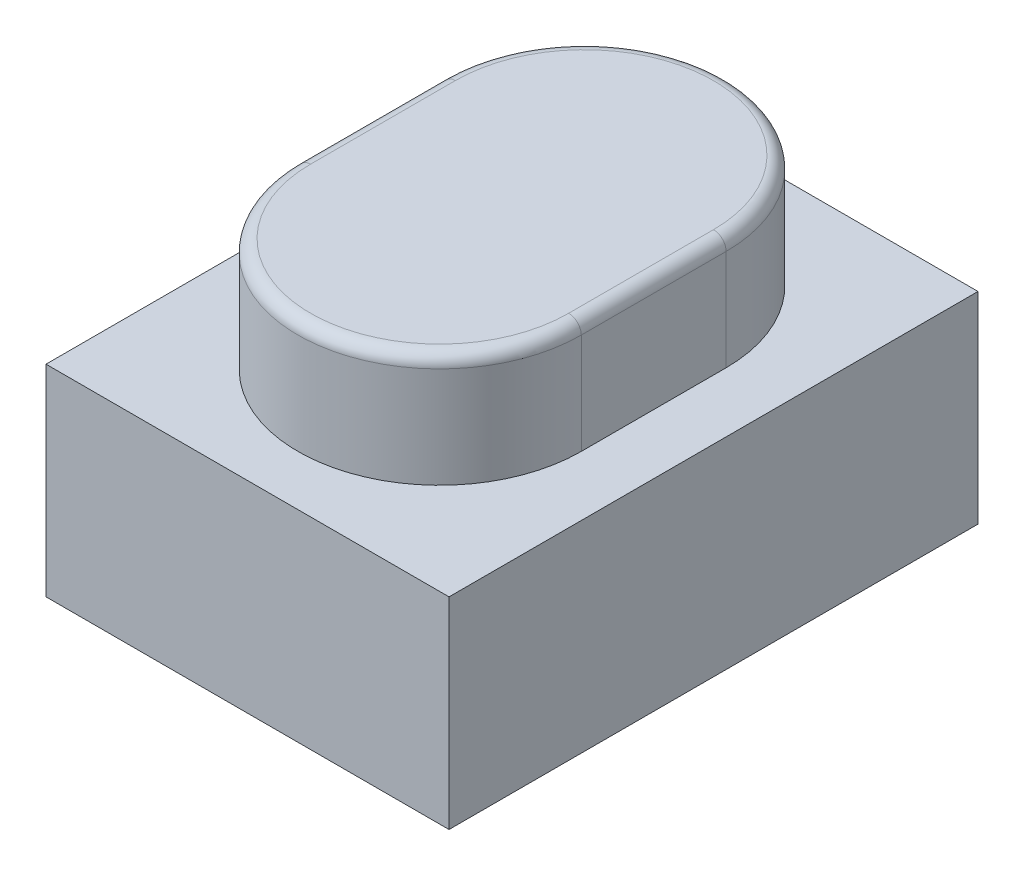
ISO-10303-21;
HEADER;
FILE_DESCRIPTION(('STEP AP214'),'2;1');
FILE_NAME('part.step','',(''),(''),'','','');
FILE_SCHEMA(('AUTOMOTIVE_DESIGN { 1 0 10303 214 1 1 1 1 }'));
ENDSEC;
DATA;
#1=APPLICATION_CONTEXT('core data for automotive mechanical design processes');
#2=APPLICATION_PROTOCOL_DEFINITION('international standard','automotive_design',2000,#1);
#3=PRODUCT_CONTEXT('',#1,'mechanical');
#4=PRODUCT('Part','Part','',(#3));
#5=PRODUCT_RELATED_PRODUCT_CATEGORY('part','',(#4));
#6=PRODUCT_DEFINITION_FORMATION('','',#4);
#7=PRODUCT_DEFINITION_CONTEXT('part definition',#1,'design');
#8=PRODUCT_DEFINITION('design','',#6,#7);
#9=PRODUCT_DEFINITION_SHAPE('','',#8);
#10=(LENGTH_UNIT() NAMED_UNIT(*) SI_UNIT(.MILLI.,.METRE.));
#11=(NAMED_UNIT(*) PLANE_ANGLE_UNIT() SI_UNIT($,.RADIAN.));
#12=(NAMED_UNIT(*) SI_UNIT($,.STERADIAN.) SOLID_ANGLE_UNIT());
#13=UNCERTAINTY_MEASURE_WITH_UNIT(LENGTH_MEASURE(1.E-05),#10,'distance_accuracy_value','');
#14=(GEOMETRIC_REPRESENTATION_CONTEXT(3) GLOBAL_UNCERTAINTY_ASSIGNED_CONTEXT((#13)) GLOBAL_UNIT_ASSIGNED_CONTEXT((#10,
#11,#12)) REPRESENTATION_CONTEXT('',''));
#15=CARTESIAN_POINT('',(0.,0.,0.));
#16=DIRECTION('',(0.,0.,1.));
#17=DIRECTION('',(1.,0.,0.));
#18=AXIS2_PLACEMENT_3D('',#15,#16,#17);
#19=CARTESIAN_POINT('',(1.6,1.6,-2.1));
#20=DIRECTION('',(-1.,0.,0.));
#21=DIRECTION('',(0.,0.,1.));
#22=AXIS2_PLACEMENT_3D('',#19,#20,#21);
#23=PLANE('',#22);
#24=DIRECTION('',(0.,0.,-1.));
#25=VECTOR('',#24,1.);
#26=CARTESIAN_POINT('',(1.6,0.,-2.1));
#27=LINE('',#26,#25);
#28=CARTESIAN_POINT('',(1.6,0.,2.1));
#29=VERTEX_POINT('',#28);
#30=CARTESIAN_POINT('',(1.6,0.,-2.1));
#31=VERTEX_POINT('',#30);
#32=EDGE_CURVE('E139',#29,#31,#27,.T.);
#33=ORIENTED_EDGE('',*,*,#32,.T.);
#34=DIRECTION('',(0.,-1.,0.));
#35=VECTOR('',#34,1.);
#36=CARTESIAN_POINT('',(1.6,1.6,-2.1));
#37=LINE('',#36,#35);
#38=CARTESIAN_POINT('',(1.6,1.6,-2.1));
#39=VERTEX_POINT('',#38);
#40=EDGE_CURVE('E166',#39,#31,#37,.T.);
#41=ORIENTED_EDGE('',*,*,#40,.F.);
#42=DIRECTION('',(0.,0.,-1.));
#43=VECTOR('',#42,1.);
#44=CARTESIAN_POINT('',(1.6,1.6,-2.1));
#45=LINE('',#44,#43);
#46=CARTESIAN_POINT('',(1.6,1.6,2.1));
#47=VERTEX_POINT('',#46);
#48=EDGE_CURVE('E140',#47,#39,#45,.T.);
#49=ORIENTED_EDGE('',*,*,#48,.F.);
#50=DIRECTION('',(0.,-1.,0.));
#51=VECTOR('',#50,1.);
#52=CARTESIAN_POINT('',(1.6,1.6,2.1));
#53=LINE('',#52,#51);
#54=EDGE_CURVE('E150',#47,#29,#53,.T.);
#55=ORIENTED_EDGE('',*,*,#54,.T.);
#56=EDGE_LOOP('',(#33,#41,#49,#55));
#57=FACE_BOUND('',#56,.T.);
#58=ADVANCED_FACE('F34',(#57),#23,.F.);
#59=CARTESIAN_POINT('',(-1.6,1.6,-2.1));
#60=DIRECTION('',(0.,0.,1.));
#61=DIRECTION('',(1.,0.,0.));
#62=AXIS2_PLACEMENT_3D('',#59,#60,#61);
#63=PLANE('',#62);
#64=DIRECTION('',(-1.,0.,0.));
#65=VECTOR('',#64,1.);
#66=CARTESIAN_POINT('',(-1.6,0.,-2.1));
#67=LINE('',#66,#65);
#68=CARTESIAN_POINT('',(-1.6,0.,-2.1));
#69=VERTEX_POINT('',#68);
#70=EDGE_CURVE('E153',#31,#69,#67,.T.);
#71=ORIENTED_EDGE('',*,*,#70,.T.);
#72=DIRECTION('',(0.,-1.,0.));
#73=VECTOR('',#72,1.);
#74=CARTESIAN_POINT('',(-1.6,1.6,-2.1));
#75=LINE('',#74,#73);
#76=CARTESIAN_POINT('',(-1.6,1.6,-2.1));
#77=VERTEX_POINT('',#76);
#78=EDGE_CURVE('E163',#77,#69,#75,.T.);
#79=ORIENTED_EDGE('',*,*,#78,.F.);
#80=DIRECTION('',(-1.,0.,0.));
#81=VECTOR('',#80,1.);
#82=CARTESIAN_POINT('',(-1.6,1.6,-2.1));
#83=LINE('',#82,#81);
#84=EDGE_CURVE('E143',#39,#77,#83,.T.);
#85=ORIENTED_EDGE('',*,*,#84,.F.);
#86=ORIENTED_EDGE('',*,*,#40,.T.);
#87=EDGE_LOOP('',(#71,#79,#85,#86));
#88=FACE_BOUND('',#87,.T.);
#89=ADVANCED_FACE('F221',(#88),#63,.F.);
#90=CARTESIAN_POINT('',(-1.6,1.6,-2.1));
#91=DIRECTION('',(1.,0.,0.));
#92=DIRECTION('',(0.,0.,-1.));
#93=AXIS2_PLACEMENT_3D('',#90,#91,#92);
#94=PLANE('',#93);
#95=DIRECTION('',(0.,0.,1.));
#96=VECTOR('',#95,1.);
#97=CARTESIAN_POINT('',(-1.6,0.,-2.1));
#98=LINE('',#97,#96);
#99=CARTESIAN_POINT('',(-1.6,0.,2.1));
#100=VERTEX_POINT('',#99);
#101=EDGE_CURVE('E155',#69,#100,#98,.T.);
#102=ORIENTED_EDGE('',*,*,#101,.T.);
#103=DIRECTION('',(0.,-1.,0.));
#104=VECTOR('',#103,1.);
#105=CARTESIAN_POINT('',(-1.6,1.6,2.1));
#106=LINE('',#105,#104);
#107=CARTESIAN_POINT('',(-1.6,1.6,2.1));
#108=VERTEX_POINT('',#107);
#109=EDGE_CURVE('E160',#108,#100,#106,.T.);
#110=ORIENTED_EDGE('',*,*,#109,.F.);
#111=DIRECTION('',(0.,0.,1.));
#112=VECTOR('',#111,1.);
#113=CARTESIAN_POINT('',(-1.6,1.6,-2.1));
#114=LINE('',#113,#112);
#115=EDGE_CURVE('E146',#77,#108,#114,.T.);
#116=ORIENTED_EDGE('',*,*,#115,.F.);
#117=ORIENTED_EDGE('',*,*,#78,.T.);
#118=EDGE_LOOP('',(#102,#110,#116,#117));
#119=FACE_BOUND('',#118,.T.);
#120=ADVANCED_FACE('F227',(#119),#94,.F.);
#121=CARTESIAN_POINT('',(-1.6,1.6,2.1));
#122=DIRECTION('',(0.,0.,-1.));
#123=DIRECTION('',(-1.,0.,0.));
#124=AXIS2_PLACEMENT_3D('',#121,#122,#123);
#125=PLANE('',#124);
#126=DIRECTION('',(1.,0.,0.));
#127=VECTOR('',#126,1.);
#128=CARTESIAN_POINT('',(-1.6,0.,2.1));
#129=LINE('',#128,#127);
#130=EDGE_CURVE('E144',#100,#29,#129,.T.);
#131=ORIENTED_EDGE('',*,*,#130,.T.);
#132=ORIENTED_EDGE('',*,*,#54,.F.);
#133=DIRECTION('',(1.,0.,0.));
#134=VECTOR('',#133,1.);
#135=CARTESIAN_POINT('',(-1.6,1.6,2.1));
#136=LINE('',#135,#134);
#137=EDGE_CURVE('E148',#108,#47,#136,.T.);
#138=ORIENTED_EDGE('',*,*,#137,.F.);
#139=ORIENTED_EDGE('',*,*,#109,.T.);
#140=EDGE_LOOP('',(#131,#132,#138,#139));
#141=FACE_BOUND('',#140,.T.);
#142=ADVANCED_FACE('F306',(#141),#125,.F.);
#143=CARTESIAN_POINT('',(0.,1.6,0.));
#144=DIRECTION('',(0.,1.,0.));
#145=DIRECTION('',(0.,0.,1.));
#146=AXIS2_PLACEMENT_3D('',#143,#144,#145);
#147=PLANE('',#146);
#148=CARTESIAN_POINT('',(0.,1.6,-0.575));
#149=DIRECTION('',(0.,1.,0.));
#150=DIRECTION('',(0.,0.,1.));
#151=AXIS2_PLACEMENT_3D('',#148,#149,#150);
#152=CIRCLE('',#151,1.125);
#153=CARTESIAN_POINT('',(1.125,1.6,-0.575000000000001));
#154=VERTEX_POINT('',#153);
#155=CARTESIAN_POINT('',(-1.125,1.6,-0.575));
#156=VERTEX_POINT('',#155);
#157=EDGE_CURVE('E130',#154,#156,#152,.T.);
#158=ORIENTED_EDGE('',*,*,#157,.F.);
#159=DIRECTION('',(0.,0.,-1.));
#160=VECTOR('',#159,1.);
#161=CARTESIAN_POINT('',(1.125,1.6,-0.575000000000001));
#162=LINE('',#161,#160);
#163=CARTESIAN_POINT('',(1.125,1.6,0.575));
#164=VERTEX_POINT('',#163);
#165=EDGE_CURVE('E127',#164,#154,#162,.T.);
#166=ORIENTED_EDGE('',*,*,#165,.F.);
#167=CARTESIAN_POINT('',(0.,1.6,0.575));
#168=DIRECTION('',(0.,1.,0.));
#169=DIRECTION('',(0.,0.,1.));
#170=AXIS2_PLACEMENT_3D('',#167,#168,#169);
#171=CIRCLE('',#170,1.125);
#172=CARTESIAN_POINT('',(-1.125,1.6,0.575));
#173=VERTEX_POINT('',#172);
#174=EDGE_CURVE('E113',#173,#164,#171,.T.);
#175=ORIENTED_EDGE('',*,*,#174,.F.);
#176=DIRECTION('',(0.,0.,1.));
#177=VECTOR('',#176,1.);
#178=CARTESIAN_POINT('',(-1.125,1.6,-0.575));
#179=LINE('',#178,#177);
#180=EDGE_CURVE('E124',#156,#173,#179,.T.);
#181=ORIENTED_EDGE('',*,*,#180,.F.);
#182=EDGE_LOOP('',(#158,#166,#175,#181));
#183=FACE_BOUND('',#182,.T.);
#184=ORIENTED_EDGE('',*,*,#48,.T.);
#185=ORIENTED_EDGE('',*,*,#84,.T.);
#186=ORIENTED_EDGE('',*,*,#115,.T.);
#187=ORIENTED_EDGE('',*,*,#137,.T.);
#188=EDGE_LOOP('',(#184,#185,#186,#187));
#189=FACE_BOUND('',#188,.T.);
#190=ADVANCED_FACE('F122',(#183,#189),#147,.T.);
#191=CARTESIAN_POINT('',(0.,0.,0.));
#192=DIRECTION('',(0.,1.,0.));
#193=DIRECTION('',(0.,0.,1.));
#194=AXIS2_PLACEMENT_3D('',#191,#192,#193);
#195=PLANE('',#194);
#196=ORIENTED_EDGE('',*,*,#32,.F.);
#197=ORIENTED_EDGE('',*,*,#130,.F.);
#198=ORIENTED_EDGE('',*,*,#101,.F.);
#199=ORIENTED_EDGE('',*,*,#70,.F.);
#200=EDGE_LOOP('',(#196,#197,#198,#199));
#201=FACE_BOUND('',#200,.T.);
#202=ADVANCED_FACE('F289',(#201),#195,.F.);
#203=CARTESIAN_POINT('',(0.,2.5,-0.575));
#204=DIRECTION('',(0.,-1.,0.));
#205=DIRECTION('',(0.,0.,-1.));
#206=AXIS2_PLACEMENT_3D('',#203,#204,#205);
#207=CYLINDRICAL_SURFACE('',#206,1.125);
#208=DIRECTION('',(0.,-1.,0.));
#209=VECTOR('',#208,1.);
#210=CARTESIAN_POINT('',(-1.125,2.5,-0.575));
#211=LINE('',#210,#209);
#212=CARTESIAN_POINT('',(-1.125,2.4,-0.575));
#213=VERTEX_POINT('',#212);
#214=EDGE_CURVE('E115',#213,#156,#211,.T.);
#215=ORIENTED_EDGE('',*,*,#214,.F.);
#216=CARTESIAN_POINT('',(0.,2.4,-0.575));
#217=DIRECTION('',(0.,1.,0.));
#218=DIRECTION('',(0.,0.,1.));
#219=AXIS2_PLACEMENT_3D('',#216,#217,#218);
#220=CIRCLE('',#219,1.125);
#221=CARTESIAN_POINT('',(1.125,2.4,-0.575000000000001));
#222=VERTEX_POINT('',#221);
#223=EDGE_CURVE('E11',#213,#222,#220,.F.);
#224=ORIENTED_EDGE('',*,*,#223,.T.);
#225=DIRECTION('',(0.,-1.,0.));
#226=VECTOR('',#225,1.);
#227=CARTESIAN_POINT('',(1.125,2.5,-0.575000000000001));
#228=LINE('',#227,#226);
#229=EDGE_CURVE('E135',#222,#154,#228,.T.);
#230=ORIENTED_EDGE('',*,*,#229,.T.);
#231=ORIENTED_EDGE('',*,*,#157,.T.);
#232=EDGE_LOOP('',(#215,#224,#230,#231));
#233=FACE_BOUND('',#232,.T.);
#234=ADVANCED_FACE('F204',(#233),#207,.T.);
#235=CARTESIAN_POINT('',(-1.125,2.5,-0.575));
#236=DIRECTION('',(1.,0.,0.));
#237=DIRECTION('',(0.,0.,-1.));
#238=AXIS2_PLACEMENT_3D('',#235,#236,#237);
#239=PLANE('',#238);
#240=DIRECTION('',(0.,-1.,0.));
#241=VECTOR('',#240,1.);
#242=CARTESIAN_POINT('',(-1.125,2.5,0.575));
#243=LINE('',#242,#241);
#244=CARTESIAN_POINT('',(-1.125,2.4,0.575));
#245=VERTEX_POINT('',#244);
#246=EDGE_CURVE('E110',#245,#173,#243,.T.);
#247=ORIENTED_EDGE('',*,*,#246,.F.);
#248=DIRECTION('',(0.,0.,1.));
#249=VECTOR('',#248,1.);
#250=CARTESIAN_POINT('',(-1.125,2.4,-0.575));
#251=LINE('',#250,#249);
#252=EDGE_CURVE('E43',#245,#213,#251,.F.);
#253=ORIENTED_EDGE('',*,*,#252,.T.);
#254=ORIENTED_EDGE('',*,*,#214,.T.);
#255=ORIENTED_EDGE('',*,*,#180,.T.);
#256=EDGE_LOOP('',(#247,#253,#254,#255));
#257=FACE_BOUND('',#256,.T.);
#258=ADVANCED_FACE('F129',(#257),#239,.F.);
#259=CARTESIAN_POINT('',(0.,2.5,0.575));
#260=DIRECTION('',(0.,-1.,0.));
#261=DIRECTION('',(0.,0.,-1.));
#262=AXIS2_PLACEMENT_3D('',#259,#260,#261);
#263=CYLINDRICAL_SURFACE('',#262,1.125);
#264=DIRECTION('',(0.,-1.,0.));
#265=VECTOR('',#264,1.);
#266=CARTESIAN_POINT('',(1.125,2.5,0.575));
#267=LINE('',#266,#265);
#268=CARTESIAN_POINT('',(1.125,2.4,0.575));
#269=VERTEX_POINT('',#268);
#270=EDGE_CURVE('E116',#269,#164,#267,.T.);
#271=ORIENTED_EDGE('',*,*,#270,.F.);
#272=CARTESIAN_POINT('',(0.,2.4,0.575));
#273=DIRECTION('',(0.,1.,0.));
#274=DIRECTION('',(0.,0.,1.));
#275=AXIS2_PLACEMENT_3D('',#272,#273,#274);
#276=CIRCLE('',#275,1.125);
#277=EDGE_CURVE('E58',#269,#245,#276,.F.);
#278=ORIENTED_EDGE('',*,*,#277,.T.);
#279=ORIENTED_EDGE('',*,*,#246,.T.);
#280=ORIENTED_EDGE('',*,*,#174,.T.);
#281=EDGE_LOOP('',(#271,#278,#279,#280));
#282=FACE_BOUND('',#281,.T.);
#283=ADVANCED_FACE('F112',(#282),#263,.T.);
#284=CARTESIAN_POINT('',(1.125,2.5,-0.575000000000001));
#285=DIRECTION('',(-1.,0.,0.));
#286=DIRECTION('',(0.,0.,1.));
#287=AXIS2_PLACEMENT_3D('',#284,#285,#286);
#288=PLANE('',#287);
#289=ORIENTED_EDGE('',*,*,#229,.F.);
#290=DIRECTION('',(0.,0.,-1.));
#291=VECTOR('',#290,1.);
#292=CARTESIAN_POINT('',(1.125,2.4,0.575));
#293=LINE('',#292,#291);
#294=EDGE_CURVE('E178',#222,#269,#293,.F.);
#295=ORIENTED_EDGE('',*,*,#294,.T.);
#296=ORIENTED_EDGE('',*,*,#270,.T.);
#297=ORIENTED_EDGE('',*,*,#165,.T.);
#298=EDGE_LOOP('',(#289,#295,#296,#297));
#299=FACE_BOUND('',#298,.T.);
#300=ADVANCED_FACE('F207',(#299),#288,.F.);
#301=CARTESIAN_POINT('',(0.,2.5,-0.575));
#302=DIRECTION('',(0.,1.,0.));
#303=DIRECTION('',(0.,0.,1.));
#304=AXIS2_PLACEMENT_3D('',#301,#302,#303);
#305=PLANE('',#304);
#306=CARTESIAN_POINT('',(0.,2.5,0.575));
#307=DIRECTION('',(0.,1.,0.));
#308=DIRECTION('',(0.,0.,1.));
#309=AXIS2_PLACEMENT_3D('',#306,#307,#308);
#310=CIRCLE('',#309,1.025);
#311=CARTESIAN_POINT('',(-1.025,2.5,0.575));
#312=VERTEX_POINT('',#311);
#313=CARTESIAN_POINT('',(1.025,2.5,0.575));
#314=VERTEX_POINT('',#313);
#315=EDGE_CURVE('E173',#312,#314,#310,.T.);
#316=ORIENTED_EDGE('',*,*,#315,.T.);
#317=DIRECTION('',(0.,0.,-1.));
#318=VECTOR('',#317,1.);
#319=CARTESIAN_POINT('',(1.025,2.5,-0.575000000000001));
#320=LINE('',#319,#318);
#321=CARTESIAN_POINT('',(1.025,2.5,-0.575000000000001));
#322=VERTEX_POINT('',#321);
#323=EDGE_CURVE('E175',#314,#322,#320,.T.);
#324=ORIENTED_EDGE('',*,*,#323,.T.);
#325=CARTESIAN_POINT('',(0.,2.5,-0.575));
#326=DIRECTION('',(0.,1.,0.));
#327=DIRECTION('',(0.,0.,1.));
#328=AXIS2_PLACEMENT_3D('',#325,#326,#327);
#329=CIRCLE('',#328,1.025);
#330=CARTESIAN_POINT('',(-1.025,2.5,-0.575));
#331=VERTEX_POINT('',#330);
#332=EDGE_CURVE('E169',#322,#331,#329,.T.);
#333=ORIENTED_EDGE('',*,*,#332,.T.);
#334=DIRECTION('',(0.,0.,1.));
#335=VECTOR('',#334,1.);
#336=CARTESIAN_POINT('',(-1.025,2.5,0.575));
#337=LINE('',#336,#335);
#338=EDGE_CURVE('E171',#331,#312,#337,.T.);
#339=ORIENTED_EDGE('',*,*,#338,.T.);
#340=EDGE_LOOP('',(#316,#324,#333,#339));
#341=FACE_BOUND('',#340,.T.);
#342=ADVANCED_FACE('F212',(#341),#305,.T.);
#343=CARTESIAN_POINT('',(-1.025,2.4,-0.575));
#344=DIRECTION('',(0.,0.,-1.));
#345=DIRECTION('',(-1.,0.,0.));
#346=AXIS2_PLACEMENT_3D('',#343,#344,#345);
#347=CYLINDRICAL_SURFACE('',#346,0.1);
#348=CARTESIAN_POINT('',(-1.025,2.4,-0.575));
#349=DIRECTION('',(0.,0.,-1.));
#350=DIRECTION('',(-1.,0.,0.));
#351=AXIS2_PLACEMENT_3D('',#348,#349,#350);
#352=CIRCLE('',#351,0.1);
#353=EDGE_CURVE('E186',#213,#331,#352,.T.);
#354=ORIENTED_EDGE('',*,*,#353,.F.);
#355=ORIENTED_EDGE('',*,*,#252,.F.);
#356=CARTESIAN_POINT('',(-1.025,2.4,0.575));
#357=DIRECTION('',(0.,0.,1.));
#358=DIRECTION('',(1.,0.,0.));
#359=AXIS2_PLACEMENT_3D('',#356,#357,#358);
#360=CIRCLE('',#359,0.1);
#361=EDGE_CURVE('E38',#312,#245,#360,.T.);
#362=ORIENTED_EDGE('',*,*,#361,.F.);
#363=ORIENTED_EDGE('',*,*,#338,.F.);
#364=EDGE_LOOP('',(#354,#355,#362,#363));
#365=FACE_BOUND('',#364,.T.);
#366=ADVANCED_FACE('F36',(#365),#347,.T.);
#367=CARTESIAN_POINT('',(0.,2.4,0.575));
#368=DIRECTION('',(0.,1.,0.));
#369=DIRECTION('',(0.,0.,1.));
#370=AXIS2_PLACEMENT_3D('',#367,#368,#369);
#371=TOROIDAL_SURFACE('',#370,1.025,0.1);
#372=ORIENTED_EDGE('',*,*,#361,.T.);
#373=ORIENTED_EDGE('',*,*,#277,.F.);
#374=CARTESIAN_POINT('',(1.025,2.4,0.575));
#375=DIRECTION('',(0.,0.,-1.));
#376=DIRECTION('',(-1.,0.,0.));
#377=AXIS2_PLACEMENT_3D('',#374,#375,#376);
#378=CIRCLE('',#377,0.1);
#379=EDGE_CURVE('E185',#314,#269,#378,.T.);
#380=ORIENTED_EDGE('',*,*,#379,.F.);
#381=ORIENTED_EDGE('',*,*,#315,.F.);
#382=EDGE_LOOP('',(#372,#373,#380,#381));
#383=FACE_BOUND('',#382,.T.);
#384=ADVANCED_FACE('F196',(#383),#371,.T.);
#385=CARTESIAN_POINT('',(0.,2.4,-0.575));
#386=DIRECTION('',(0.,1.,0.));
#387=DIRECTION('',(0.,0.,1.));
#388=AXIS2_PLACEMENT_3D('',#385,#386,#387);
#389=TOROIDAL_SURFACE('',#388,1.025,0.1);
#390=ORIENTED_EDGE('',*,*,#353,.T.);
#391=ORIENTED_EDGE('',*,*,#332,.F.);
#392=CARTESIAN_POINT('',(1.025,2.4,-0.575000000000001));
#393=DIRECTION('',(0.,0.,1.));
#394=DIRECTION('',(1.,0.,0.));
#395=AXIS2_PLACEMENT_3D('',#392,#393,#394);
#396=CIRCLE('',#395,0.1);
#397=EDGE_CURVE('E183',#222,#322,#396,.T.);
#398=ORIENTED_EDGE('',*,*,#397,.F.);
#399=ORIENTED_EDGE('',*,*,#223,.F.);
#400=EDGE_LOOP('',(#390,#391,#398,#399));
#401=FACE_BOUND('',#400,.T.);
#402=ADVANCED_FACE('F201',(#401),#389,.T.);
#403=CARTESIAN_POINT('',(1.025,2.4,-0.575));
#404=DIRECTION('',(0.,0.,1.));
#405=DIRECTION('',(1.,0.,0.));
#406=AXIS2_PLACEMENT_3D('',#403,#404,#405);
#407=CYLINDRICAL_SURFACE('',#406,0.1);
#408=ORIENTED_EDGE('',*,*,#379,.T.);
#409=ORIENTED_EDGE('',*,*,#294,.F.);
#410=ORIENTED_EDGE('',*,*,#397,.T.);
#411=ORIENTED_EDGE('',*,*,#323,.F.);
#412=EDGE_LOOP('',(#408,#409,#410,#411));
#413=FACE_BOUND('',#412,.T.);
#414=ADVANCED_FACE('F209',(#413),#407,.T.);
#415=CLOSED_SHELL('',(#58,#89,#120,#142,#190,#202,#234,#258,#283,#300,#342,#366,#384,#402,#414));
#416=MANIFOLD_SOLID_BREP('B2',#415);
#417=ADVANCED_BREP_SHAPE_REPRESENTATION('',(#18,#416),#14);
#418=SHAPE_DEFINITION_REPRESENTATION(#9,#417);
ENDSEC;
END-ISO-10303-21;
